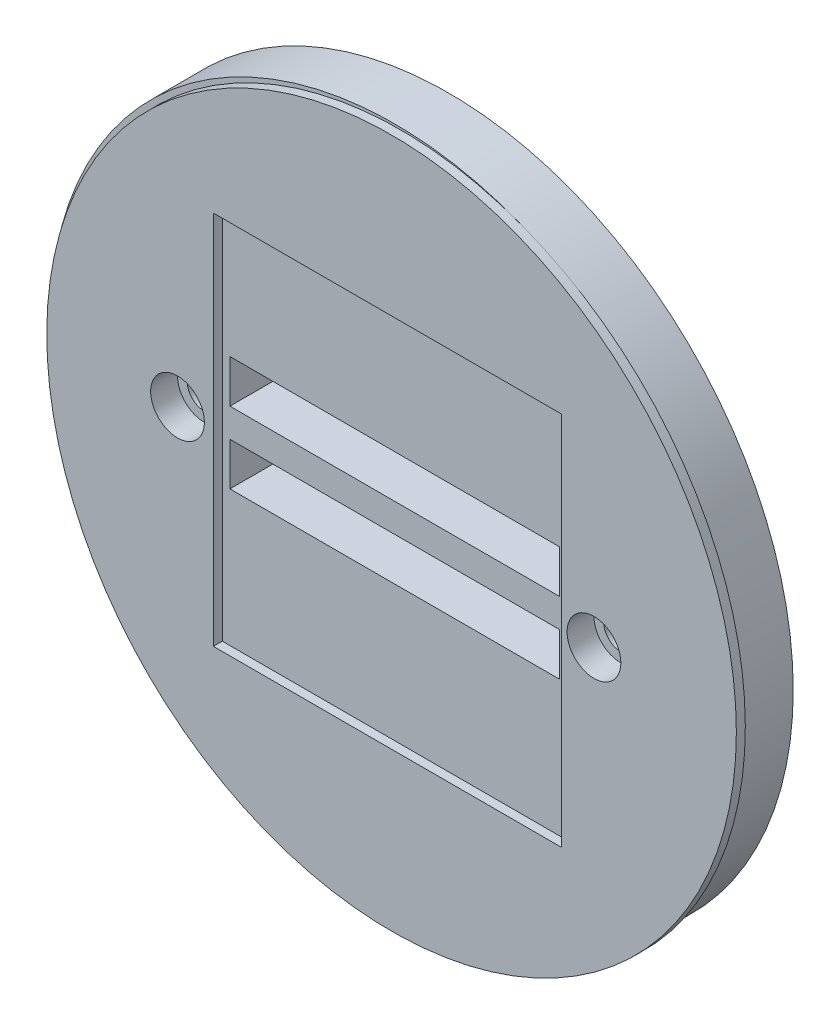
ISO-10303-21;
HEADER;
FILE_DESCRIPTION(('STEP AP214'),'2;1');
FILE_NAME('part.step','',(''),(''),'','','');
FILE_SCHEMA(('AUTOMOTIVE_DESIGN { 1 0 10303 214 1 1 1 1 }'));
ENDSEC;
DATA;
#1=APPLICATION_CONTEXT('core data for automotive mechanical design processes');
#2=APPLICATION_PROTOCOL_DEFINITION('international standard','automotive_design',2000,#1);
#3=PRODUCT_CONTEXT('',#1,'mechanical');
#4=PRODUCT('Part','Part','',(#3));
#5=PRODUCT_RELATED_PRODUCT_CATEGORY('part','',(#4));
#6=PRODUCT_DEFINITION_FORMATION('','',#4);
#7=PRODUCT_DEFINITION_CONTEXT('part definition',#1,'design');
#8=PRODUCT_DEFINITION('design','',#6,#7);
#9=PRODUCT_DEFINITION_SHAPE('','',#8);
#10=(LENGTH_UNIT() NAMED_UNIT(*) SI_UNIT(.MILLI.,.METRE.));
#11=(NAMED_UNIT(*) PLANE_ANGLE_UNIT() SI_UNIT($,.RADIAN.));
#12=(NAMED_UNIT(*) SI_UNIT($,.STERADIAN.) SOLID_ANGLE_UNIT());
#13=UNCERTAINTY_MEASURE_WITH_UNIT(LENGTH_MEASURE(1.E-05),#10,'distance_accuracy_value','');
#14=(GEOMETRIC_REPRESENTATION_CONTEXT(3) GLOBAL_UNCERTAINTY_ASSIGNED_CONTEXT((#13)) GLOBAL_UNIT_ASSIGNED_CONTEXT((#10,
#11,#12)) REPRESENTATION_CONTEXT('',''));
#15=CARTESIAN_POINT('',(0.,0.,0.));
#16=DIRECTION('',(0.,0.,1.));
#17=DIRECTION('',(1.,0.,0.));
#18=AXIS2_PLACEMENT_3D('',#15,#16,#17);
#19=CARTESIAN_POINT('',(23.25,0.,-6.));
#20=DIRECTION('',(0.,0.,1.));
#21=DIRECTION('',(1.,0.,0.));
#22=AXIS2_PLACEMENT_3D('',#19,#20,#21);
#23=CYLINDRICAL_SURFACE('',#22,1.925);
#24=CARTESIAN_POINT('',(23.25,0.,-6.));
#25=DIRECTION('',(0.,0.,1.));
#26=DIRECTION('',(-1.,0.,0.));
#27=AXIS2_PLACEMENT_3D('',#24,#25,#26);
#28=CIRCLE('',#27,1.925);
#29=CARTESIAN_POINT('',(21.325,0.,-6.));
#30=VERTEX_POINT('',#29);
#31=EDGE_CURVE('E175',#30,#30,#28,.T.);
#32=ORIENTED_EDGE('',*,*,#31,.F.);
#33=EDGE_LOOP('',(#32));
#34=FACE_BOUND('',#33,.T.);
#35=CARTESIAN_POINT('',(23.25,0.,-2.));
#36=DIRECTION('',(0.,0.,1.));
#37=DIRECTION('',(1.,0.,0.));
#38=AXIS2_PLACEMENT_3D('',#35,#36,#37);
#39=CIRCLE('',#38,1.925);
#40=CARTESIAN_POINT('',(25.175,0.,-2.));
#41=VERTEX_POINT('',#40);
#42=EDGE_CURVE('E36',#41,#41,#39,.F.);
#43=ORIENTED_EDGE('',*,*,#42,.F.);
#44=EDGE_LOOP('',(#43));
#45=FACE_BOUND('',#44,.T.);
#46=ADVANCED_FACE('F32',(#34,#45),#23,.F.);
#47=CARTESIAN_POINT('',(-23.25,0.,-6.));
#48=DIRECTION('',(0.,0.,1.));
#49=DIRECTION('',(1.,0.,0.));
#50=AXIS2_PLACEMENT_3D('',#47,#48,#49);
#51=CYLINDRICAL_SURFACE('',#50,1.925);
#52=CARTESIAN_POINT('',(-23.25,0.,-6.));
#53=DIRECTION('',(0.,0.,1.));
#54=DIRECTION('',(1.,0.,0.));
#55=AXIS2_PLACEMENT_3D('',#52,#53,#54);
#56=CIRCLE('',#55,1.925);
#57=CARTESIAN_POINT('',(-21.325,0.,-6.));
#58=VERTEX_POINT('',#57);
#59=EDGE_CURVE('E205',#58,#58,#56,.T.);
#60=ORIENTED_EDGE('',*,*,#59,.F.);
#61=EDGE_LOOP('',(#60));
#62=FACE_BOUND('',#61,.T.);
#63=CARTESIAN_POINT('',(-23.25,0.,-2.));
#64=DIRECTION('',(0.,0.,1.));
#65=DIRECTION('',(1.,0.,0.));
#66=AXIS2_PLACEMENT_3D('',#63,#64,#65);
#67=CIRCLE('',#66,1.925);
#68=CARTESIAN_POINT('',(-21.325,0.,-2.));
#69=VERTEX_POINT('',#68);
#70=EDGE_CURVE('E161',#69,#69,#67,.F.);
#71=ORIENTED_EDGE('',*,*,#70,.F.);
#72=EDGE_LOOP('',(#71));
#73=FACE_BOUND('',#72,.T.);
#74=ADVANCED_FACE('F271',(#62,#73),#51,.F.);
#75=CARTESIAN_POINT('',(0.,0.,0.));
#76=DIRECTION('',(0.,0.,1.));
#77=DIRECTION('',(1.,0.,0.));
#78=AXIS2_PLACEMENT_3D('',#75,#76,#77);
#79=PLANE('',#78);
#80=DIRECTION('',(-1.,0.,0.));
#81=VECTOR('',#80,1.);
#82=CARTESIAN_POINT('',(-18.4,6.79999999999948,0.));
#83=LINE('',#82,#81);
#84=CARTESIAN_POINT('',(18.4,6.79999999999948,0.));
#85=VERTEX_POINT('',#84);
#86=CARTESIAN_POINT('',(-18.4,6.79999999999948,0.));
#87=VERTEX_POINT('',#86);
#88=EDGE_CURVE('E214',#85,#87,#83,.T.);
#89=ORIENTED_EDGE('',*,*,#88,.F.);
#90=DIRECTION('',(0.,1.,0.));
#91=VECTOR('',#90,1.);
#92=CARTESIAN_POINT('',(18.4,6.79999999999948,0.));
#93=LINE('',#92,#91);
#94=CARTESIAN_POINT('',(18.4,1.99999999999948,0.));
#95=VERTEX_POINT('',#94);
#96=EDGE_CURVE('E219',#95,#85,#93,.T.);
#97=ORIENTED_EDGE('',*,*,#96,.F.);
#98=DIRECTION('',(1.,0.,0.));
#99=VECTOR('',#98,1.);
#100=CARTESIAN_POINT('',(18.4,1.99999999999948,0.));
#101=LINE('',#100,#99);
#102=CARTESIAN_POINT('',(-18.4,1.99999999999948,0.));
#103=VERTEX_POINT('',#102);
#104=EDGE_CURVE('E233',#103,#95,#101,.T.);
#105=ORIENTED_EDGE('',*,*,#104,.F.);
#106=DIRECTION('',(0.,-1.,0.));
#107=VECTOR('',#106,1.);
#108=CARTESIAN_POINT('',(-18.4,1.99999999999948,0.));
#109=LINE('',#108,#107);
#110=EDGE_CURVE('E230',#87,#103,#109,.T.);
#111=ORIENTED_EDGE('',*,*,#110,.F.);
#112=EDGE_LOOP('',(#89,#97,#105,#111));
#113=FACE_BOUND('',#112,.T.);
#114=DIRECTION('',(0.,1.,0.));
#115=VECTOR('',#114,1.);
#116=CARTESIAN_POINT('',(18.4,-6.00000000000038,0.));
#117=LINE('',#116,#115);
#118=CARTESIAN_POINT('',(18.4,-6.00000000000038,0.));
#119=VERTEX_POINT('',#118);
#120=CARTESIAN_POINT('',(18.4,-1.20000000000037,0.));
#121=VERTEX_POINT('',#120);
#122=EDGE_CURVE('E179',#119,#121,#117,.T.);
#123=ORIENTED_EDGE('',*,*,#122,.F.);
#124=DIRECTION('',(1.,0.,0.));
#125=VECTOR('',#124,1.);
#126=CARTESIAN_POINT('',(-18.4,-6.00000000000038,0.));
#127=LINE('',#126,#125);
#128=CARTESIAN_POINT('',(-18.4,-6.00000000000038,0.));
#129=VERTEX_POINT('',#128);
#130=EDGE_CURVE('E184',#129,#119,#127,.T.);
#131=ORIENTED_EDGE('',*,*,#130,.F.);
#132=DIRECTION('',(0.,-1.,0.));
#133=VECTOR('',#132,1.);
#134=CARTESIAN_POINT('',(-18.4,-1.20000000000038,0.));
#135=LINE('',#134,#133);
#136=CARTESIAN_POINT('',(-18.4,-1.20000000000038,0.));
#137=VERTEX_POINT('',#136);
#138=EDGE_CURVE('E198',#137,#129,#135,.T.);
#139=ORIENTED_EDGE('',*,*,#138,.F.);
#140=DIRECTION('',(-1.,0.,0.));
#141=VECTOR('',#140,1.);
#142=CARTESIAN_POINT('',(18.4,-1.20000000000037,0.));
#143=LINE('',#142,#141);
#144=EDGE_CURVE('E195',#121,#137,#143,.T.);
#145=ORIENTED_EDGE('',*,*,#144,.F.);
#146=EDGE_LOOP('',(#123,#131,#139,#145));
#147=FACE_BOUND('',#146,.T.);
#148=DIRECTION('',(1.,0.,0.));
#149=VECTOR('',#148,1.);
#150=CARTESIAN_POINT('',(-19.25,-21.15,0.));
#151=LINE('',#150,#149);
#152=CARTESIAN_POINT('',(-19.25,-21.15,0.));
#153=VERTEX_POINT('',#152);
#154=CARTESIAN_POINT('',(19.65,-21.15,0.));
#155=VERTEX_POINT('',#154);
#156=EDGE_CURVE('E139',#153,#155,#151,.T.);
#157=ORIENTED_EDGE('',*,*,#156,.T.);
#158=DIRECTION('',(0.,1.,0.));
#159=VECTOR('',#158,1.);
#160=CARTESIAN_POINT('',(19.65,20.75,0.));
#161=LINE('',#160,#159);
#162=CARTESIAN_POINT('',(19.65,20.75,0.));
#163=VERTEX_POINT('',#162);
#164=EDGE_CURVE('E159',#155,#163,#161,.T.);
#165=ORIENTED_EDGE('',*,*,#164,.T.);
#166=DIRECTION('',(-1.,0.,0.));
#167=VECTOR('',#166,1.);
#168=CARTESIAN_POINT('',(-19.25,20.75,0.));
#169=LINE('',#168,#167);
#170=CARTESIAN_POINT('',(-19.25,20.75,0.));
#171=VERTEX_POINT('',#170);
#172=EDGE_CURVE('E145',#163,#171,#169,.T.);
#173=ORIENTED_EDGE('',*,*,#172,.T.);
#174=DIRECTION('',(0.,-1.,0.));
#175=VECTOR('',#174,1.);
#176=CARTESIAN_POINT('',(-19.25,20.75,0.));
#177=LINE('',#176,#175);
#178=EDGE_CURVE('E163',#171,#153,#177,.T.);
#179=ORIENTED_EDGE('',*,*,#178,.T.);
#180=EDGE_LOOP('',(#157,#165,#173,#179));
#181=FACE_BOUND('',#180,.T.);
#182=ADVANCED_FACE('F277',(#113,#147,#181),#79,.T.);
#183=CARTESIAN_POINT('',(0.,0.,-6.));
#184=DIRECTION('',(0.,0.,1.));
#185=DIRECTION('',(1.,0.,0.));
#186=AXIS2_PLACEMENT_3D('',#183,#184,#185);
#187=CYLINDRICAL_SURFACE('',#186,38.5);
#188=CARTESIAN_POINT('',(0.,0.,-6.));
#189=DIRECTION('',(0.,0.,1.));
#190=DIRECTION('',(1.,0.,0.));
#191=AXIS2_PLACEMENT_3D('',#188,#189,#190);
#192=CIRCLE('',#191,38.5);
#193=CARTESIAN_POINT('',(38.5,0.,-6.));
#194=VERTEX_POINT('',#193);
#195=EDGE_CURVE('E11',#194,#194,#192,.T.);
#196=ORIENTED_EDGE('',*,*,#195,.T.);
#197=EDGE_LOOP('',(#196));
#198=FACE_BOUND('',#197,.T.);
#199=CARTESIAN_POINT('',(0.,0.,0.));
#200=DIRECTION('',(0.,0.,1.));
#201=DIRECTION('',(1.,0.,0.));
#202=AXIS2_PLACEMENT_3D('',#199,#200,#201);
#203=CIRCLE('',#202,38.5);
#204=CARTESIAN_POINT('',(14.1451292663319,35.8073360924652,0.));
#205=VERTEX_POINT('',#204);
#206=CARTESIAN_POINT('',(-13.4951292663333,-36.0573360924646,0.));
#207=VERTEX_POINT('',#206);
#208=EDGE_CURVE('E41',#205,#207,#203,.T.);
#209=ORIENTED_EDGE('',*,*,#208,.F.);
#210=EDGE_CURVE('E240',#207,#205,#203,.T.);
#211=ORIENTED_EDGE('',*,*,#210,.F.);
#212=EDGE_LOOP('',(#209,#211));
#213=FACE_BOUND('',#212,.T.);
#214=ADVANCED_FACE('F34',(#198,#213),#187,.T.);
#215=CARTESIAN_POINT('',(0.,0.,-6.));
#216=DIRECTION('',(0.,0.,1.));
#217=DIRECTION('',(1.,0.,0.));
#218=AXIS2_PLACEMENT_3D('',#215,#216,#217);
#219=PLANE('',#218);
#220=ORIENTED_EDGE('',*,*,#31,.T.);
#221=EDGE_LOOP('',(#220));
#222=FACE_BOUND('',#221,.T.);
#223=DIRECTION('',(1.,0.,0.));
#224=VECTOR('',#223,1.);
#225=CARTESIAN_POINT('',(-18.4,-6.00000000000038,-6.));
#226=LINE('',#225,#224);
#227=CARTESIAN_POINT('',(-18.4,-6.00000000000038,-6.));
#228=VERTEX_POINT('',#227);
#229=CARTESIAN_POINT('',(18.4,-6.00000000000038,-6.));
#230=VERTEX_POINT('',#229);
#231=EDGE_CURVE('E190',#228,#230,#226,.T.);
#232=ORIENTED_EDGE('',*,*,#231,.T.);
#233=DIRECTION('',(0.,1.,0.));
#234=VECTOR('',#233,1.);
#235=CARTESIAN_POINT('',(18.4,-6.00000000000038,-6.));
#236=LINE('',#235,#234);
#237=CARTESIAN_POINT('',(18.4,-1.20000000000037,-6.));
#238=VERTEX_POINT('',#237);
#239=EDGE_CURVE('E180',#230,#238,#236,.T.);
#240=ORIENTED_EDGE('',*,*,#239,.T.);
#241=DIRECTION('',(-1.,0.,0.));
#242=VECTOR('',#241,1.);
#243=CARTESIAN_POINT('',(18.4,-1.20000000000037,-6.));
#244=LINE('',#243,#242);
#245=CARTESIAN_POINT('',(-18.4,-1.20000000000038,-6.));
#246=VERTEX_POINT('',#245);
#247=EDGE_CURVE('E183',#238,#246,#244,.T.);
#248=ORIENTED_EDGE('',*,*,#247,.T.);
#249=DIRECTION('',(0.,-1.,0.));
#250=VECTOR('',#249,1.);
#251=CARTESIAN_POINT('',(-18.4,-1.20000000000038,-6.));
#252=LINE('',#251,#250);
#253=EDGE_CURVE('E187',#246,#228,#252,.T.);
#254=ORIENTED_EDGE('',*,*,#253,.T.);
#255=EDGE_LOOP('',(#232,#240,#248,#254));
#256=FACE_BOUND('',#255,.T.);
#257=ORIENTED_EDGE('',*,*,#59,.T.);
#258=EDGE_LOOP('',(#257));
#259=FACE_BOUND('',#258,.T.);
#260=DIRECTION('',(0.,1.,0.));
#261=VECTOR('',#260,1.);
#262=CARTESIAN_POINT('',(18.4,6.79999999999948,-6.));
#263=LINE('',#262,#261);
#264=CARTESIAN_POINT('',(18.4,1.99999999999948,-6.));
#265=VERTEX_POINT('',#264);
#266=CARTESIAN_POINT('',(18.4,6.79999999999948,-6.));
#267=VERTEX_POINT('',#266);
#268=EDGE_CURVE('E225',#265,#267,#263,.T.);
#269=ORIENTED_EDGE('',*,*,#268,.T.);
#270=DIRECTION('',(-1.,0.,0.));
#271=VECTOR('',#270,1.);
#272=CARTESIAN_POINT('',(-18.4,6.79999999999948,-6.));
#273=LINE('',#272,#271);
#274=CARTESIAN_POINT('',(-18.4,6.79999999999948,-6.));
#275=VERTEX_POINT('',#274);
#276=EDGE_CURVE('E215',#267,#275,#273,.T.);
#277=ORIENTED_EDGE('',*,*,#276,.T.);
#278=DIRECTION('',(0.,-1.,0.));
#279=VECTOR('',#278,1.);
#280=CARTESIAN_POINT('',(-18.4,1.99999999999948,-6.));
#281=LINE('',#280,#279);
#282=CARTESIAN_POINT('',(-18.4,1.99999999999948,-6.));
#283=VERTEX_POINT('',#282);
#284=EDGE_CURVE('E218',#275,#283,#281,.T.);
#285=ORIENTED_EDGE('',*,*,#284,.T.);
#286=DIRECTION('',(1.,0.,0.));
#287=VECTOR('',#286,1.);
#288=CARTESIAN_POINT('',(18.4,1.99999999999948,-6.));
#289=LINE('',#288,#287);
#290=EDGE_CURVE('E222',#283,#265,#289,.T.);
#291=ORIENTED_EDGE('',*,*,#290,.T.);
#292=EDGE_LOOP('',(#269,#277,#285,#291));
#293=FACE_BOUND('',#292,.T.);
#294=ORIENTED_EDGE('',*,*,#195,.F.);
#295=EDGE_LOOP('',(#294));
#296=FACE_BOUND('',#295,.T.);
#297=ADVANCED_FACE('F319',(#222,#256,#259,#293,#296),#219,.F.);
#298=CARTESIAN_POINT('',(0.649999999999995,-0.249999999999997,0.));
#299=DIRECTION('',(0.,0.,1.));
#300=DIRECTION('',(1.,0.,0.));
#301=AXIS2_PLACEMENT_3D('',#298,#299,#300);
#302=CIRCLE('',#301,38.5);
#303=EDGE_CURVE('E56',#205,#207,#302,.T.);
#304=ORIENTED_EDGE('',*,*,#303,.F.);
#305=ORIENTED_EDGE('',*,*,#208,.T.);
#306=EDGE_LOOP('',(#304,#305));
#307=FACE_BOUND('',#306,.T.);
#308=ADVANCED_FACE('F317',(#307),#79,.T.);
#309=CARTESIAN_POINT('',(-18.4,6.79999999999948,-6.));
#310=DIRECTION('',(0.,1.,0.));
#311=DIRECTION('',(-1.,0.,0.));
#312=AXIS2_PLACEMENT_3D('',#309,#310,#311);
#313=PLANE('',#312);
#314=ORIENTED_EDGE('',*,*,#88,.T.);
#315=DIRECTION('',(0.,0.,1.));
#316=VECTOR('',#315,1.);
#317=CARTESIAN_POINT('',(-18.4,6.79999999999948,-6.));
#318=LINE('',#317,#316);
#319=EDGE_CURVE('E228',#275,#87,#318,.T.);
#320=ORIENTED_EDGE('',*,*,#319,.F.);
#321=ORIENTED_EDGE('',*,*,#276,.F.);
#322=DIRECTION('',(0.,0.,1.));
#323=VECTOR('',#322,1.);
#324=CARTESIAN_POINT('',(18.4,6.79999999999948,-6.));
#325=LINE('',#324,#323);
#326=EDGE_CURVE('E238',#267,#85,#325,.T.);
#327=ORIENTED_EDGE('',*,*,#326,.T.);
#328=EDGE_LOOP('',(#314,#320,#321,#327));
#329=FACE_BOUND('',#328,.T.);
#330=ADVANCED_FACE('F307',(#329),#313,.F.);
#331=CARTESIAN_POINT('',(18.4,6.79999999999948,-6.));
#332=DIRECTION('',(1.,0.,0.));
#333=DIRECTION('',(0.,0.,-1.));
#334=AXIS2_PLACEMENT_3D('',#331,#332,#333);
#335=PLANE('',#334);
#336=ORIENTED_EDGE('',*,*,#96,.T.);
#337=ORIENTED_EDGE('',*,*,#326,.F.);
#338=ORIENTED_EDGE('',*,*,#268,.F.);
#339=DIRECTION('',(0.,0.,1.));
#340=VECTOR('',#339,1.);
#341=CARTESIAN_POINT('',(18.4,1.99999999999948,-6.));
#342=LINE('',#341,#340);
#343=EDGE_CURVE('E241',#265,#95,#342,.T.);
#344=ORIENTED_EDGE('',*,*,#343,.T.);
#345=EDGE_LOOP('',(#336,#337,#338,#344));
#346=FACE_BOUND('',#345,.T.);
#347=ADVANCED_FACE('F303',(#346),#335,.F.);
#348=CARTESIAN_POINT('',(18.4,1.99999999999948,-6.));
#349=DIRECTION('',(0.,-1.,0.));
#350=DIRECTION('',(1.,0.,0.));
#351=AXIS2_PLACEMENT_3D('',#348,#349,#350);
#352=PLANE('',#351);
#353=ORIENTED_EDGE('',*,*,#104,.T.);
#354=ORIENTED_EDGE('',*,*,#343,.F.);
#355=ORIENTED_EDGE('',*,*,#290,.F.);
#356=DIRECTION('',(0.,0.,1.));
#357=VECTOR('',#356,1.);
#358=CARTESIAN_POINT('',(-18.4,1.99999999999948,-6.));
#359=LINE('',#358,#357);
#360=EDGE_CURVE('E243',#283,#103,#359,.T.);
#361=ORIENTED_EDGE('',*,*,#360,.T.);
#362=EDGE_LOOP('',(#353,#354,#355,#361));
#363=FACE_BOUND('',#362,.T.);
#364=ADVANCED_FACE('F306',(#363),#352,.F.);
#365=CARTESIAN_POINT('',(-18.4,1.99999999999948,-6.));
#366=DIRECTION('',(-1.,0.,0.));
#367=DIRECTION('',(0.,0.,1.));
#368=AXIS2_PLACEMENT_3D('',#365,#366,#367);
#369=PLANE('',#368);
#370=ORIENTED_EDGE('',*,*,#110,.T.);
#371=ORIENTED_EDGE('',*,*,#360,.F.);
#372=ORIENTED_EDGE('',*,*,#284,.F.);
#373=ORIENTED_EDGE('',*,*,#319,.T.);
#374=EDGE_LOOP('',(#370,#371,#372,#373));
#375=FACE_BOUND('',#374,.T.);
#376=ADVANCED_FACE('F300',(#375),#369,.F.);
#377=CARTESIAN_POINT('',(18.4,-6.00000000000038,-6.));
#378=DIRECTION('',(1.,0.,0.));
#379=DIRECTION('',(0.,0.,-1.));
#380=AXIS2_PLACEMENT_3D('',#377,#378,#379);
#381=PLANE('',#380);
#382=ORIENTED_EDGE('',*,*,#122,.T.);
#383=DIRECTION('',(0.,0.,1.));
#384=VECTOR('',#383,1.);
#385=CARTESIAN_POINT('',(18.4,-1.20000000000037,-6.));
#386=LINE('',#385,#384);
#387=EDGE_CURVE('E193',#238,#121,#386,.T.);
#388=ORIENTED_EDGE('',*,*,#387,.F.);
#389=ORIENTED_EDGE('',*,*,#239,.F.);
#390=DIRECTION('',(0.,0.,1.));
#391=VECTOR('',#390,1.);
#392=CARTESIAN_POINT('',(18.4,-6.00000000000038,-6.));
#393=LINE('',#392,#391);
#394=EDGE_CURVE('E203',#230,#119,#393,.T.);
#395=ORIENTED_EDGE('',*,*,#394,.T.);
#396=EDGE_LOOP('',(#382,#388,#389,#395));
#397=FACE_BOUND('',#396,.T.);
#398=ADVANCED_FACE('F289',(#397),#381,.F.);
#399=CARTESIAN_POINT('',(-18.4,-6.00000000000038,-6.));
#400=DIRECTION('',(0.,-1.,0.));
#401=DIRECTION('',(0.,0.,-1.));
#402=AXIS2_PLACEMENT_3D('',#399,#400,#401);
#403=PLANE('',#402);
#404=ORIENTED_EDGE('',*,*,#130,.T.);
#405=ORIENTED_EDGE('',*,*,#394,.F.);
#406=ORIENTED_EDGE('',*,*,#231,.F.);
#407=DIRECTION('',(0.,0.,1.));
#408=VECTOR('',#407,1.);
#409=CARTESIAN_POINT('',(-18.4,-6.00000000000038,-6.));
#410=LINE('',#409,#408);
#411=EDGE_CURVE('E206',#228,#129,#410,.T.);
#412=ORIENTED_EDGE('',*,*,#411,.T.);
#413=EDGE_LOOP('',(#404,#405,#406,#412));
#414=FACE_BOUND('',#413,.T.);
#415=ADVANCED_FACE('F285',(#414),#403,.F.);
#416=CARTESIAN_POINT('',(-18.4,-1.20000000000038,-6.));
#417=DIRECTION('',(-1.,0.,0.));
#418=DIRECTION('',(0.,0.,1.));
#419=AXIS2_PLACEMENT_3D('',#416,#417,#418);
#420=PLANE('',#419);
#421=ORIENTED_EDGE('',*,*,#138,.T.);
#422=ORIENTED_EDGE('',*,*,#411,.F.);
#423=ORIENTED_EDGE('',*,*,#253,.F.);
#424=DIRECTION('',(0.,0.,1.));
#425=VECTOR('',#424,1.);
#426=CARTESIAN_POINT('',(-18.4,-1.20000000000038,-6.));
#427=LINE('',#426,#425);
#428=EDGE_CURVE('E208',#246,#137,#427,.T.);
#429=ORIENTED_EDGE('',*,*,#428,.T.);
#430=EDGE_LOOP('',(#421,#422,#423,#429));
#431=FACE_BOUND('',#430,.T.);
#432=ADVANCED_FACE('F288',(#431),#420,.F.);
#433=CARTESIAN_POINT('',(18.4,-1.20000000000037,-6.));
#434=DIRECTION('',(0.,1.,0.));
#435=DIRECTION('',(-1.,0.,0.));
#436=AXIS2_PLACEMENT_3D('',#433,#434,#435);
#437=PLANE('',#436);
#438=ORIENTED_EDGE('',*,*,#144,.T.);
#439=ORIENTED_EDGE('',*,*,#428,.F.);
#440=ORIENTED_EDGE('',*,*,#247,.F.);
#441=ORIENTED_EDGE('',*,*,#387,.T.);
#442=EDGE_LOOP('',(#438,#439,#440,#441));
#443=FACE_BOUND('',#442,.T.);
#444=ADVANCED_FACE('F293',(#443),#437,.F.);
#445=CARTESIAN_POINT('',(0.649999999999995,-0.249999999999997,0.));
#446=DIRECTION('',(0.,0.,1.));
#447=DIRECTION('',(1.,0.,0.));
#448=AXIS2_PLACEMENT_3D('',#445,#446,#447);
#449=PLANE('',#448);
#450=EDGE_CURVE('E146',#207,#205,#302,.T.);
#451=ORIENTED_EDGE('',*,*,#450,.F.);
#452=ORIENTED_EDGE('',*,*,#210,.T.);
#453=EDGE_LOOP('',(#451,#452));
#454=FACE_BOUND('',#453,.T.);
#455=ADVANCED_FACE('F297',(#454),#449,.F.);
#456=CARTESIAN_POINT('',(0.649999999999995,-0.249999999999997,1.));
#457=DIRECTION('',(0.,0.,1.));
#458=DIRECTION('',(1.,0.,0.));
#459=AXIS2_PLACEMENT_3D('',#456,#457,#458);
#460=PLANE('',#459);
#461=CARTESIAN_POINT('',(23.25,0.,1.));
#462=DIRECTION('',(0.,0.,1.));
#463=DIRECTION('',(1.,0.,0.));
#464=AXIS2_PLACEMENT_3D('',#461,#462,#463);
#465=CIRCLE('',#464,3.);
#466=CARTESIAN_POINT('',(26.25,0.,1.));
#467=VERTEX_POINT('',#466);
#468=EDGE_CURVE('E258',#467,#467,#465,.T.);
#469=ORIENTED_EDGE('',*,*,#468,.F.);
#470=EDGE_LOOP('',(#469));
#471=FACE_BOUND('',#470,.T.);
#472=CARTESIAN_POINT('',(-23.25,0.,1.));
#473=DIRECTION('',(0.,0.,1.));
#474=DIRECTION('',(1.,0.,0.));
#475=AXIS2_PLACEMENT_3D('',#472,#473,#474);
#476=CIRCLE('',#475,3.);
#477=CARTESIAN_POINT('',(-20.25,0.,1.));
#478=VERTEX_POINT('',#477);
#479=EDGE_CURVE('E252',#478,#478,#476,.T.);
#480=ORIENTED_EDGE('',*,*,#479,.F.);
#481=EDGE_LOOP('',(#480));
#482=FACE_BOUND('',#481,.T.);
#483=CARTESIAN_POINT('',(0.649999999999995,-0.249999999999997,1.));
#484=DIRECTION('',(0.,0.,1.));
#485=DIRECTION('',(1.,0.,0.));
#486=AXIS2_PLACEMENT_3D('',#483,#484,#485);
#487=CIRCLE('',#486,38.5);
#488=CARTESIAN_POINT('',(39.15,-0.249999999999997,1.));
#489=VERTEX_POINT('',#488);
#490=EDGE_CURVE('E172',#489,#489,#487,.T.);
#491=ORIENTED_EDGE('',*,*,#490,.T.);
#492=EDGE_LOOP('',(#491));
#493=FACE_BOUND('',#492,.T.);
#494=DIRECTION('',(-1.,0.,0.));
#495=VECTOR('',#494,1.);
#496=CARTESIAN_POINT('',(-19.25,20.75,1.));
#497=LINE('',#496,#495);
#498=CARTESIAN_POINT('',(19.65,20.75,1.));
#499=VERTEX_POINT('',#498);
#500=CARTESIAN_POINT('',(-19.25,20.75,1.));
#501=VERTEX_POINT('',#500);
#502=EDGE_CURVE('E138',#499,#501,#497,.T.);
#503=ORIENTED_EDGE('',*,*,#502,.F.);
#504=DIRECTION('',(0.,1.,0.));
#505=VECTOR('',#504,1.);
#506=CARTESIAN_POINT('',(19.65,20.75,1.));
#507=LINE('',#506,#505);
#508=CARTESIAN_POINT('',(19.65,-21.15,1.));
#509=VERTEX_POINT('',#508);
#510=EDGE_CURVE('E130',#509,#499,#507,.T.);
#511=ORIENTED_EDGE('',*,*,#510,.F.);
#512=DIRECTION('',(1.,0.,0.));
#513=VECTOR('',#512,1.);
#514=CARTESIAN_POINT('',(-19.25,-21.15,1.));
#515=LINE('',#514,#513);
#516=CARTESIAN_POINT('',(-19.25,-21.15,1.));
#517=VERTEX_POINT('',#516);
#518=EDGE_CURVE('E154',#517,#509,#515,.T.);
#519=ORIENTED_EDGE('',*,*,#518,.F.);
#520=DIRECTION('',(0.,-1.,0.));
#521=VECTOR('',#520,1.);
#522=CARTESIAN_POINT('',(-19.25,20.75,1.));
#523=LINE('',#522,#521);
#524=EDGE_CURVE('E152',#501,#517,#523,.T.);
#525=ORIENTED_EDGE('',*,*,#524,.F.);
#526=EDGE_LOOP('',(#503,#511,#519,#525));
#527=FACE_BOUND('',#526,.T.);
#528=ADVANCED_FACE('F150',(#471,#482,#493,#527),#460,.T.);
#529=CARTESIAN_POINT('',(0.649999999999995,-0.249999999999997,1.));
#530=DIRECTION('',(0.,0.,-1.));
#531=DIRECTION('',(-1.,0.,0.));
#532=AXIS2_PLACEMENT_3D('',#529,#530,#531);
#533=CYLINDRICAL_SURFACE('',#532,38.5);
#534=ORIENTED_EDGE('',*,*,#490,.F.);
#535=EDGE_LOOP('',(#534));
#536=FACE_BOUND('',#535,.T.);
#537=ORIENTED_EDGE('',*,*,#303,.T.);
#538=ORIENTED_EDGE('',*,*,#450,.T.);
#539=EDGE_LOOP('',(#537,#538));
#540=FACE_BOUND('',#539,.T.);
#541=ADVANCED_FACE('F283',(#536,#540),#533,.T.);
#542=CARTESIAN_POINT('',(19.65,20.75,1.));
#543=DIRECTION('',(-1.,0.,0.));
#544=DIRECTION('',(0.,-1.,0.));
#545=AXIS2_PLACEMENT_3D('',#542,#543,#544);
#546=PLANE('',#545);
#547=ORIENTED_EDGE('',*,*,#164,.F.);
#548=DIRECTION('',(0.,0.,-1.));
#549=VECTOR('',#548,1.);
#550=CARTESIAN_POINT('',(19.65,-21.15,1.));
#551=LINE('',#550,#549);
#552=EDGE_CURVE('E49',#509,#155,#551,.T.);
#553=ORIENTED_EDGE('',*,*,#552,.F.);
#554=ORIENTED_EDGE('',*,*,#510,.T.);
#555=DIRECTION('',(0.,0.,-1.));
#556=VECTOR('',#555,1.);
#557=CARTESIAN_POINT('',(19.65,20.75,1.));
#558=LINE('',#557,#556);
#559=EDGE_CURVE('E133',#499,#163,#558,.T.);
#560=ORIENTED_EDGE('',*,*,#559,.T.);
#561=EDGE_LOOP('',(#547,#553,#554,#560));
#562=FACE_BOUND('',#561,.T.);
#563=ADVANCED_FACE('F132',(#562),#546,.T.);
#564=CARTESIAN_POINT('',(-19.25,20.75,1.));
#565=DIRECTION('',(0.,-1.,0.));
#566=DIRECTION('',(0.,0.,-1.));
#567=AXIS2_PLACEMENT_3D('',#564,#565,#566);
#568=PLANE('',#567);
#569=ORIENTED_EDGE('',*,*,#172,.F.);
#570=ORIENTED_EDGE('',*,*,#559,.F.);
#571=ORIENTED_EDGE('',*,*,#502,.T.);
#572=DIRECTION('',(0.,0.,-1.));
#573=VECTOR('',#572,1.);
#574=CARTESIAN_POINT('',(-19.25,20.75,1.));
#575=LINE('',#574,#573);
#576=EDGE_CURVE('E147',#501,#171,#575,.T.);
#577=ORIENTED_EDGE('',*,*,#576,.T.);
#578=EDGE_LOOP('',(#569,#570,#571,#577));
#579=FACE_BOUND('',#578,.T.);
#580=ADVANCED_FACE('F142',(#579),#568,.T.);
#581=CARTESIAN_POINT('',(-19.25,20.75,1.));
#582=DIRECTION('',(1.,0.,0.));
#583=DIRECTION('',(0.,1.,0.));
#584=AXIS2_PLACEMENT_3D('',#581,#582,#583);
#585=PLANE('',#584);
#586=ORIENTED_EDGE('',*,*,#178,.F.);
#587=ORIENTED_EDGE('',*,*,#576,.F.);
#588=ORIENTED_EDGE('',*,*,#524,.T.);
#589=DIRECTION('',(0.,0.,-1.));
#590=VECTOR('',#589,1.);
#591=CARTESIAN_POINT('',(-19.25,-21.15,1.));
#592=LINE('',#591,#590);
#593=EDGE_CURVE('E169',#517,#153,#592,.T.);
#594=ORIENTED_EDGE('',*,*,#593,.T.);
#595=EDGE_LOOP('',(#586,#587,#588,#594));
#596=FACE_BOUND('',#595,.T.);
#597=ADVANCED_FACE('F342',(#596),#585,.T.);
#598=CARTESIAN_POINT('',(-19.25,-21.15,1.));
#599=DIRECTION('',(0.,1.,0.));
#600=DIRECTION('',(0.,0.,1.));
#601=AXIS2_PLACEMENT_3D('',#598,#599,#600);
#602=PLANE('',#601);
#603=ORIENTED_EDGE('',*,*,#156,.F.);
#604=ORIENTED_EDGE('',*,*,#593,.F.);
#605=ORIENTED_EDGE('',*,*,#518,.T.);
#606=ORIENTED_EDGE('',*,*,#552,.T.);
#607=EDGE_LOOP('',(#603,#604,#605,#606));
#608=FACE_BOUND('',#607,.T.);
#609=ADVANCED_FACE('F340',(#608),#602,.T.);
#610=CARTESIAN_POINT('',(-23.25,0.,-2.));
#611=DIRECTION('',(0.,0.,1.));
#612=DIRECTION('',(1.,0.,0.));
#613=AXIS2_PLACEMENT_3D('',#610,#611,#612);
#614=PLANE('',#613);
#615=CARTESIAN_POINT('',(-23.25,0.,-2.));
#616=DIRECTION('',(0.,0.,1.));
#617=DIRECTION('',(1.,0.,0.));
#618=AXIS2_PLACEMENT_3D('',#615,#616,#617);
#619=CIRCLE('',#618,3.);
#620=CARTESIAN_POINT('',(-20.25,0.,-2.));
#621=VERTEX_POINT('',#620);
#622=EDGE_CURVE('E248',#621,#621,#619,.T.);
#623=ORIENTED_EDGE('',*,*,#622,.T.);
#624=EDGE_LOOP('',(#623));
#625=FACE_BOUND('',#624,.T.);
#626=ORIENTED_EDGE('',*,*,#70,.T.);
#627=EDGE_LOOP('',(#626));
#628=FACE_BOUND('',#627,.T.);
#629=ADVANCED_FACE('F349',(#625,#628),#614,.T.);
#630=CARTESIAN_POINT('',(-23.25,0.,-2.));
#631=DIRECTION('',(0.,0.,1.));
#632=DIRECTION('',(1.,0.,0.));
#633=AXIS2_PLACEMENT_3D('',#630,#631,#632);
#634=CYLINDRICAL_SURFACE('',#633,3.);
#635=ORIENTED_EDGE('',*,*,#622,.F.);
#636=EDGE_LOOP('',(#635));
#637=FACE_BOUND('',#636,.T.);
#638=ORIENTED_EDGE('',*,*,#479,.T.);
#639=EDGE_LOOP('',(#638));
#640=FACE_BOUND('',#639,.T.);
#641=ADVANCED_FACE('F417',(#637,#640),#634,.F.);
#642=CARTESIAN_POINT('',(23.25,0.,-2.));
#643=DIRECTION('',(0.,0.,1.));
#644=DIRECTION('',(1.,0.,0.));
#645=AXIS2_PLACEMENT_3D('',#642,#643,#644);
#646=PLANE('',#645);
#647=CARTESIAN_POINT('',(23.25,0.,-2.));
#648=DIRECTION('',(0.,0.,1.));
#649=DIRECTION('',(1.,0.,0.));
#650=AXIS2_PLACEMENT_3D('',#647,#648,#649);
#651=CIRCLE('',#650,3.);
#652=CARTESIAN_POINT('',(26.25,0.,-2.));
#653=VERTEX_POINT('',#652);
#654=EDGE_CURVE('E261',#653,#653,#651,.T.);
#655=ORIENTED_EDGE('',*,*,#654,.T.);
#656=EDGE_LOOP('',(#655));
#657=FACE_BOUND('',#656,.T.);
#658=ORIENTED_EDGE('',*,*,#42,.T.);
#659=EDGE_LOOP('',(#658));
#660=FACE_BOUND('',#659,.T.);
#661=ADVANCED_FACE('F268',(#657,#660),#646,.T.);
#662=CARTESIAN_POINT('',(23.25,0.,-2.));
#663=DIRECTION('',(0.,0.,1.));
#664=DIRECTION('',(1.,0.,0.));
#665=AXIS2_PLACEMENT_3D('',#662,#663,#664);
#666=CYLINDRICAL_SURFACE('',#665,3.);
#667=ORIENTED_EDGE('',*,*,#654,.F.);
#668=EDGE_LOOP('',(#667));
#669=FACE_BOUND('',#668,.T.);
#670=ORIENTED_EDGE('',*,*,#468,.T.);
#671=EDGE_LOOP('',(#670));
#672=FACE_BOUND('',#671,.T.);
#673=ADVANCED_FACE('F434',(#669,#672),#666,.F.);
#674=CLOSED_SHELL('',(#46,#74,#182,#214,#297,#308,#330,#347,#364,#376,#398,#415,#432,#444,#455,
#528,#541,#563,#580,#597,#609,#629,#641,#661,#673));
#675=MANIFOLD_SOLID_BREP('B2',#674);
#676=ADVANCED_BREP_SHAPE_REPRESENTATION('',(#18,#675),#14);
#677=SHAPE_DEFINITION_REPRESENTATION(#9,#676);
ENDSEC;
END-ISO-10303-21;
